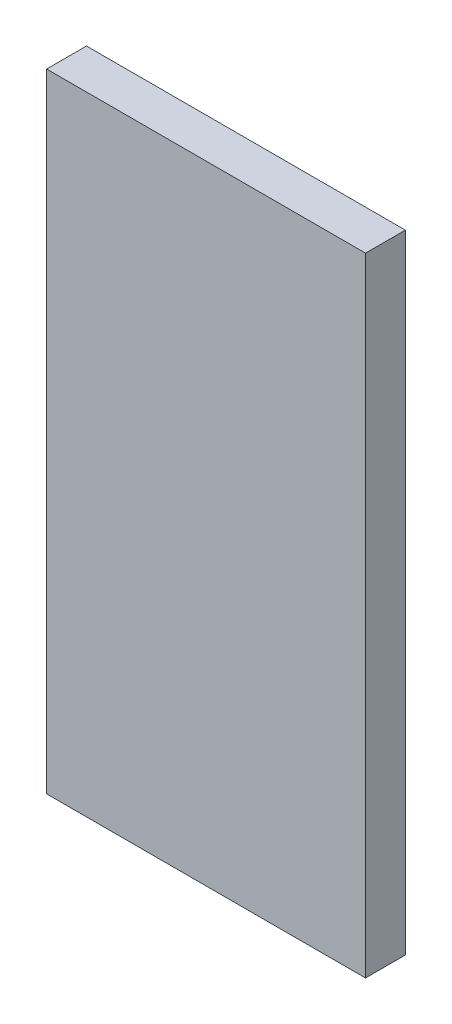
ISO-10303-21;
HEADER;
FILE_DESCRIPTION(('STEP AP214'),'2;1');
FILE_NAME('part.step','',(''),(''),'','','');
FILE_SCHEMA(('AUTOMOTIVE_DESIGN { 1 0 10303 214 1 1 1 1 }'));
ENDSEC;
DATA;
#1=APPLICATION_CONTEXT('core data for automotive mechanical design processes');
#2=APPLICATION_PROTOCOL_DEFINITION('international standard','automotive_design',2000,#1);
#3=PRODUCT_CONTEXT('',#1,'mechanical');
#4=PRODUCT('Part','Part','',(#3));
#5=PRODUCT_RELATED_PRODUCT_CATEGORY('part','',(#4));
#6=PRODUCT_DEFINITION_FORMATION('','',#4);
#7=PRODUCT_DEFINITION_CONTEXT('part definition',#1,'design');
#8=PRODUCT_DEFINITION('design','',#6,#7);
#9=PRODUCT_DEFINITION_SHAPE('','',#8);
#10=(LENGTH_UNIT() NAMED_UNIT(*) SI_UNIT(.MILLI.,.METRE.));
#11=(NAMED_UNIT(*) PLANE_ANGLE_UNIT() SI_UNIT($,.RADIAN.));
#12=(NAMED_UNIT(*) SI_UNIT($,.STERADIAN.) SOLID_ANGLE_UNIT());
#13=UNCERTAINTY_MEASURE_WITH_UNIT(LENGTH_MEASURE(1.E-05),#10,'distance_accuracy_value','');
#14=(GEOMETRIC_REPRESENTATION_CONTEXT(3) GLOBAL_UNCERTAINTY_ASSIGNED_CONTEXT((#13)) GLOBAL_UNIT_ASSIGNED_CONTEXT((#10,
#11,#12)) REPRESENTATION_CONTEXT('',''));
#15=CARTESIAN_POINT('',(0.,0.,0.));
#16=DIRECTION('',(0.,0.,1.));
#17=DIRECTION('',(1.,0.,0.));
#18=AXIS2_PLACEMENT_3D('',#15,#16,#17);
#19=CARTESIAN_POINT('',(0.,0.,6.35));
#20=DIRECTION('',(1.,0.,0.));
#21=DIRECTION('',(0.,1.,0.));
#22=AXIS2_PLACEMENT_3D('',#19,#20,#21);
#23=PLANE('',#22);
#24=DIRECTION('',(0.,-1.,0.));
#25=VECTOR('',#24,1.);
#26=CARTESIAN_POINT('',(0.,0.,0.));
#27=LINE('',#26,#25);
#28=CARTESIAN_POINT('',(0.,0.,0.));
#29=VERTEX_POINT('',#28);
#30=CARTESIAN_POINT('',(0.,-100.,0.));
#31=VERTEX_POINT('',#30);
#32=EDGE_CURVE('E105',#29,#31,#27,.T.);
#33=ORIENTED_EDGE('',*,*,#32,.T.);
#34=DIRECTION('',(0.,0.,-1.));
#35=VECTOR('',#34,1.);
#36=CARTESIAN_POINT('',(0.,-100.,6.35));
#37=LINE('',#36,#35);
#38=CARTESIAN_POINT('',(0.,-100.,6.35));
#39=VERTEX_POINT('',#38);
#40=EDGE_CURVE('E11',#39,#31,#37,.T.);
#41=ORIENTED_EDGE('',*,*,#40,.F.);
#42=DIRECTION('',(0.,-1.,0.));
#43=VECTOR('',#42,1.);
#44=CARTESIAN_POINT('',(0.,0.,6.35));
#45=LINE('',#44,#43);
#46=CARTESIAN_POINT('',(0.,0.,6.35));
#47=VERTEX_POINT('',#46);
#48=EDGE_CURVE('E89',#47,#39,#45,.T.);
#49=ORIENTED_EDGE('',*,*,#48,.F.);
#50=DIRECTION('',(0.,0.,-1.));
#51=VECTOR('',#50,1.);
#52=CARTESIAN_POINT('',(0.,0.,6.35));
#53=LINE('',#52,#51);
#54=EDGE_CURVE('E97',#47,#29,#53,.T.);
#55=ORIENTED_EDGE('',*,*,#54,.T.);
#56=EDGE_LOOP('',(#33,#41,#49,#55));
#57=FACE_BOUND('',#56,.T.);
#58=ADVANCED_FACE('F39',(#57),#23,.F.);
#59=CARTESIAN_POINT('',(0.,-100.,6.35));
#60=DIRECTION('',(0.,1.,0.));
#61=DIRECTION('',(0.,0.,1.));
#62=AXIS2_PLACEMENT_3D('',#59,#60,#61);
#63=PLANE('',#62);
#64=DIRECTION('',(1.,0.,0.));
#65=VECTOR('',#64,1.);
#66=CARTESIAN_POINT('',(0.,-100.,0.));
#67=LINE('',#66,#65);
#68=CARTESIAN_POINT('',(50.8,-100.,0.));
#69=VERTEX_POINT('',#68);
#70=EDGE_CURVE('E92',#31,#69,#67,.T.);
#71=ORIENTED_EDGE('',*,*,#70,.T.);
#72=DIRECTION('',(0.,0.,-1.));
#73=VECTOR('',#72,1.);
#74=CARTESIAN_POINT('',(50.8,-100.,6.35));
#75=LINE('',#74,#73);
#76=CARTESIAN_POINT('',(50.8,-100.,6.35));
#77=VERTEX_POINT('',#76);
#78=EDGE_CURVE('E50',#77,#69,#75,.T.);
#79=ORIENTED_EDGE('',*,*,#78,.F.);
#80=DIRECTION('',(1.,0.,0.));
#81=VECTOR('',#80,1.);
#82=CARTESIAN_POINT('',(0.,-100.,6.35));
#83=LINE('',#82,#81);
#84=EDGE_CURVE('E82',#39,#77,#83,.T.);
#85=ORIENTED_EDGE('',*,*,#84,.F.);
#86=ORIENTED_EDGE('',*,*,#40,.T.);
#87=EDGE_LOOP('',(#71,#79,#85,#86));
#88=FACE_BOUND('',#87,.T.);
#89=ADVANCED_FACE('F93',(#88),#63,.F.);
#90=CARTESIAN_POINT('',(50.8,0.,6.35));
#91=DIRECTION('',(-1.,0.,0.));
#92=DIRECTION('',(0.,-1.,0.));
#93=AXIS2_PLACEMENT_3D('',#90,#91,#92);
#94=PLANE('',#93);
#95=DIRECTION('',(0.,1.,0.));
#96=VECTOR('',#95,1.);
#97=CARTESIAN_POINT('',(50.8,0.,0.));
#98=LINE('',#97,#96);
#99=CARTESIAN_POINT('',(50.8,0.,0.));
#100=VERTEX_POINT('',#99);
#101=EDGE_CURVE('E75',#69,#100,#98,.T.);
#102=ORIENTED_EDGE('',*,*,#101,.T.);
#103=DIRECTION('',(0.,0.,-1.));
#104=VECTOR('',#103,1.);
#105=CARTESIAN_POINT('',(50.8,0.,6.35));
#106=LINE('',#105,#104);
#107=CARTESIAN_POINT('',(50.8,0.,6.35));
#108=VERTEX_POINT('',#107);
#109=EDGE_CURVE('E94',#108,#100,#106,.T.);
#110=ORIENTED_EDGE('',*,*,#109,.F.);
#111=DIRECTION('',(0.,1.,0.));
#112=VECTOR('',#111,1.);
#113=CARTESIAN_POINT('',(50.8,0.,6.35));
#114=LINE('',#113,#112);
#115=EDGE_CURVE('E88',#77,#108,#114,.T.);
#116=ORIENTED_EDGE('',*,*,#115,.F.);
#117=ORIENTED_EDGE('',*,*,#78,.T.);
#118=EDGE_LOOP('',(#102,#110,#116,#117));
#119=FACE_BOUND('',#118,.T.);
#120=ADVANCED_FACE('F96',(#119),#94,.F.);
#121=CARTESIAN_POINT('',(0.,0.,6.35));
#122=DIRECTION('',(0.,-1.,0.));
#123=DIRECTION('',(0.,0.,-1.));
#124=AXIS2_PLACEMENT_3D('',#121,#122,#123);
#125=PLANE('',#124);
#126=DIRECTION('',(-1.,0.,0.));
#127=VECTOR('',#126,1.);
#128=CARTESIAN_POINT('',(0.,0.,0.));
#129=LINE('',#128,#127);
#130=EDGE_CURVE('E76',#100,#29,#129,.T.);
#131=ORIENTED_EDGE('',*,*,#130,.T.);
#132=ORIENTED_EDGE('',*,*,#54,.F.);
#133=DIRECTION('',(-1.,0.,0.));
#134=VECTOR('',#133,1.);
#135=CARTESIAN_POINT('',(0.,0.,6.35));
#136=LINE('',#135,#134);
#137=EDGE_CURVE('E54',#108,#47,#136,.T.);
#138=ORIENTED_EDGE('',*,*,#137,.F.);
#139=ORIENTED_EDGE('',*,*,#109,.T.);
#140=EDGE_LOOP('',(#131,#132,#138,#139));
#141=FACE_BOUND('',#140,.T.);
#142=ADVANCED_FACE('F109',(#141),#125,.F.);
#143=CARTESIAN_POINT('',(0.,0.,6.35));
#144=DIRECTION('',(0.,0.,1.));
#145=DIRECTION('',(1.,0.,0.));
#146=AXIS2_PLACEMENT_3D('',#143,#144,#145);
#147=PLANE('',#146);
#148=ORIENTED_EDGE('',*,*,#48,.T.);
#149=ORIENTED_EDGE('',*,*,#84,.T.);
#150=ORIENTED_EDGE('',*,*,#115,.T.);
#151=ORIENTED_EDGE('',*,*,#137,.T.);
#152=EDGE_LOOP('',(#148,#149,#150,#151));
#153=FACE_BOUND('',#152,.T.);
#154=ADVANCED_FACE('F86',(#153),#147,.T.);
#155=CARTESIAN_POINT('',(0.,0.,0.));
#156=DIRECTION('',(0.,0.,1.));
#157=DIRECTION('',(1.,0.,0.));
#158=AXIS2_PLACEMENT_3D('',#155,#156,#157);
#159=PLANE('',#158);
#160=ORIENTED_EDGE('',*,*,#32,.F.);
#161=ORIENTED_EDGE('',*,*,#130,.F.);
#162=ORIENTED_EDGE('',*,*,#101,.F.);
#163=ORIENTED_EDGE('',*,*,#70,.F.);
#164=EDGE_LOOP('',(#160,#161,#162,#163));
#165=FACE_BOUND('',#164,.T.);
#166=ADVANCED_FACE('F115',(#165),#159,.F.);
#167=CLOSED_SHELL('',(#58,#89,#120,#142,#154,#166));
#168=MANIFOLD_SOLID_BREP('B2',#167);
#169=ADVANCED_BREP_SHAPE_REPRESENTATION('',(#18,#168),#14);
#170=SHAPE_DEFINITION_REPRESENTATION(#9,#169);
ENDSEC;
END-ISO-10303-21;
